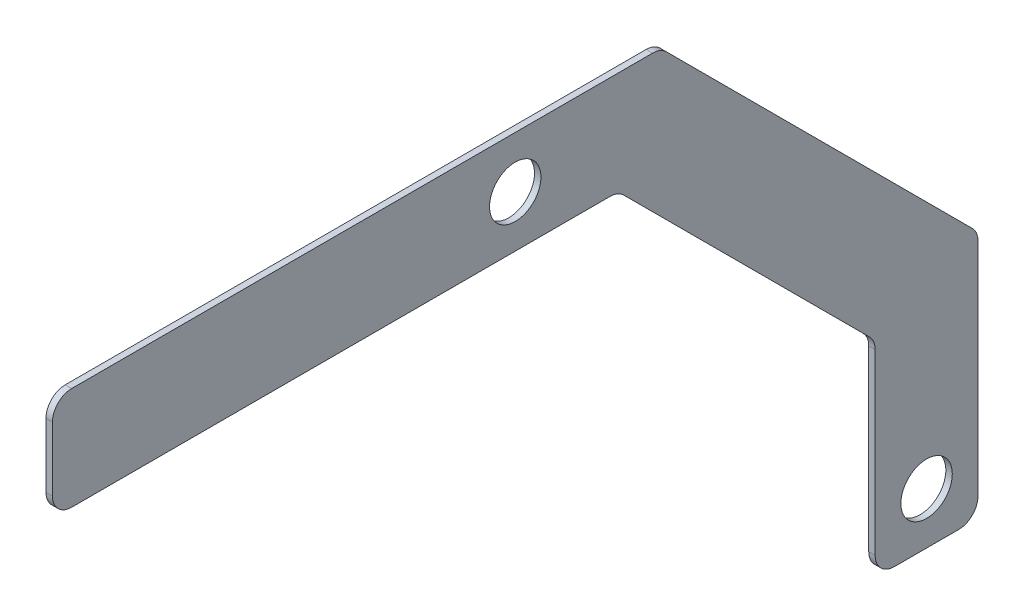
ISO-10303-21;
HEADER;
FILE_DESCRIPTION(('STEP AP214'),'2;1');
FILE_NAME('part.step','',(''),(''),'','','');
FILE_SCHEMA(('AUTOMOTIVE_DESIGN { 1 0 10303 214 1 1 1 1 }'));
ENDSEC;
DATA;
#1=APPLICATION_CONTEXT('core data for automotive mechanical design processes');
#2=APPLICATION_PROTOCOL_DEFINITION('international standard','automotive_design',2000,#1);
#3=PRODUCT_CONTEXT('',#1,'mechanical');
#4=PRODUCT('Part','Part','',(#3));
#5=PRODUCT_RELATED_PRODUCT_CATEGORY('part','',(#4));
#6=PRODUCT_DEFINITION_FORMATION('','',#4);
#7=PRODUCT_DEFINITION_CONTEXT('part definition',#1,'design');
#8=PRODUCT_DEFINITION('design','',#6,#7);
#9=PRODUCT_DEFINITION_SHAPE('','',#8);
#10=(LENGTH_UNIT() NAMED_UNIT(*) SI_UNIT(.MILLI.,.METRE.));
#11=(NAMED_UNIT(*) PLANE_ANGLE_UNIT() SI_UNIT($,.RADIAN.));
#12=(NAMED_UNIT(*) SI_UNIT($,.STERADIAN.) SOLID_ANGLE_UNIT());
#13=UNCERTAINTY_MEASURE_WITH_UNIT(LENGTH_MEASURE(1.E-05),#10,'distance_accuracy_value','');
#14=(GEOMETRIC_REPRESENTATION_CONTEXT(3) GLOBAL_UNCERTAINTY_ASSIGNED_CONTEXT((#13)) GLOBAL_UNIT_ASSIGNED_CONTEXT((#10,
#11,#12)) REPRESENTATION_CONTEXT('',''));
#15=CARTESIAN_POINT('',(0.,0.,0.));
#16=DIRECTION('',(0.,0.,1.));
#17=DIRECTION('',(1.,0.,0.));
#18=AXIS2_PLACEMENT_3D('',#15,#16,#17);
#19=CARTESIAN_POINT('',(3.175,0.,0.));
#20=DIRECTION('',(1.,0.,0.));
#21=DIRECTION('',(0.,0.,-1.));
#22=AXIS2_PLACEMENT_3D('',#19,#20,#21);
#23=PLANE('',#22);
#24=DIRECTION('',(0.,0.,-1.));
#25=VECTOR('',#24,1.);
#26=CARTESIAN_POINT('',(3.175,-254.,-228.6));
#27=LINE('',#26,#25);
#28=CARTESIAN_POINT('',(3.175,-254.,-187.325));
#29=VERTEX_POINT('',#28);
#30=CARTESIAN_POINT('',(3.175,-254.,-219.075));
#31=VERTEX_POINT('',#30);
#32=EDGE_CURVE('E277',#29,#31,#27,.T.);
#33=ORIENTED_EDGE('',*,*,#32,.T.);
#34=CARTESIAN_POINT('',(3.175,-244.475,-219.075));
#35=DIRECTION('',(1.,0.,0.));
#36=DIRECTION('',(0.,0.,-1.));
#37=AXIS2_PLACEMENT_3D('',#34,#35,#36);
#38=CIRCLE('',#37,9.525);
#39=CARTESIAN_POINT('',(3.175,-244.475,-228.6));
#40=VERTEX_POINT('',#39);
#41=EDGE_CURVE('E209',#31,#40,#38,.T.);
#42=ORIENTED_EDGE('',*,*,#41,.T.);
#43=DIRECTION('',(0.,1.,0.));
#44=VECTOR('',#43,1.);
#45=CARTESIAN_POINT('',(3.175,25.3999999999999,-228.6));
#46=LINE('',#45,#44);
#47=CARTESIAN_POINT('',(3.175,-135.303335213051,-228.6));
#48=VERTEX_POINT('',#47);
#49=EDGE_CURVE('E168',#40,#48,#46,.T.);
#50=ORIENTED_EDGE('',*,*,#49,.T.);
#51=CARTESIAN_POINT('',(3.175,-135.303335213051,-219.075));
#52=DIRECTION('',(1.,0.,0.));
#53=DIRECTION('',(0.,0.,-1.));
#54=AXIS2_PLACEMENT_3D('',#51,#52,#53);
#55=CIRCLE('',#54,9.525);
#56=CARTESIAN_POINT('',(3.175,-128.568143122249,-225.810192090802));
#57=VERTEX_POINT('',#56);
#58=EDGE_CURVE('E205',#48,#57,#55,.T.);
#59=ORIENTED_EDGE('',*,*,#58,.T.);
#60=DIRECTION('',(0.,-0.707106781186547,-0.707106781186547));
#61=VECTOR('',#60,1.);
#62=CARTESIAN_POINT('',(3.175,25.3999999999999,-71.8420489685532));
#63=LINE('',#62,#61);
#64=CARTESIAN_POINT('',(3.175,22.6101920908018,-74.6318568777513));
#65=VERTEX_POINT('',#64);
#66=EDGE_CURVE('E296',#65,#57,#63,.T.);
#67=ORIENTED_EDGE('',*,*,#66,.F.);
#68=CARTESIAN_POINT('',(3.175,15.875,-67.8966647869494));
#69=DIRECTION('',(1.,0.,0.));
#70=DIRECTION('',(0.,0.,-1.));
#71=AXIS2_PLACEMENT_3D('',#68,#69,#70);
#72=CIRCLE('',#71,9.525);
#73=CARTESIAN_POINT('',(3.175,25.4,-67.8966647869495));
#74=VERTEX_POINT('',#73);
#75=EDGE_CURVE('E203',#65,#74,#72,.T.);
#76=ORIENTED_EDGE('',*,*,#75,.T.);
#77=DIRECTION('',(0.,0.,1.));
#78=VECTOR('',#77,1.);
#79=CARTESIAN_POINT('',(3.175,25.4,228.6));
#80=LINE('',#79,#78);
#81=CARTESIAN_POINT('',(3.175,25.4,219.075));
#82=VERTEX_POINT('',#81);
#83=EDGE_CURVE('E187',#74,#82,#80,.T.);
#84=ORIENTED_EDGE('',*,*,#83,.T.);
#85=CARTESIAN_POINT('',(3.175,15.875,219.075));
#86=DIRECTION('',(1.,0.,0.));
#87=DIRECTION('',(0.,0.,-1.));
#88=AXIS2_PLACEMENT_3D('',#85,#86,#87);
#89=CIRCLE('',#88,9.525);
#90=CARTESIAN_POINT('',(3.175,15.875,228.6));
#91=VERTEX_POINT('',#90);
#92=EDGE_CURVE('E199',#82,#91,#89,.T.);
#93=ORIENTED_EDGE('',*,*,#92,.T.);
#94=DIRECTION('',(0.,-1.,0.));
#95=VECTOR('',#94,1.);
#96=CARTESIAN_POINT('',(3.175,25.4,228.6));
#97=LINE('',#96,#95);
#98=CARTESIAN_POINT('',(3.175,-15.875,228.6));
#99=VERTEX_POINT('',#98);
#100=EDGE_CURVE('E181',#91,#99,#97,.T.);
#101=ORIENTED_EDGE('',*,*,#100,.T.);
#102=CARTESIAN_POINT('',(3.175,-15.875,219.075));
#103=DIRECTION('',(1.,0.,0.));
#104=DIRECTION('',(0.,0.,-1.));
#105=AXIS2_PLACEMENT_3D('',#102,#103,#104);
#106=CIRCLE('',#105,9.525);
#107=CARTESIAN_POINT('',(3.175,-25.4,219.075));
#108=VERTEX_POINT('',#107);
#109=EDGE_CURVE('E201',#99,#108,#106,.T.);
#110=ORIENTED_EDGE('',*,*,#109,.T.);
#111=DIRECTION('',(0.,0.,-1.));
#112=VECTOR('',#111,1.);
#113=CARTESIAN_POINT('',(3.175,-25.4,177.8));
#114=LINE('',#113,#112);
#115=CARTESIAN_POINT('',(3.175,-25.4,-46.8546158183961));
#116=VERTEX_POINT('',#115);
#117=EDGE_CURVE('E247',#108,#116,#114,.T.);
#118=ORIENTED_EDGE('',*,*,#117,.T.);
#119=CARTESIAN_POINT('',(3.175,-34.925,-46.8546158183961));
#120=DIRECTION('',(1.,0.,0.));
#121=DIRECTION('',(0.,0.,-1.));
#122=AXIS2_PLACEMENT_3D('',#119,#120,#121);
#123=CIRCLE('',#122,9.525);
#124=CARTESIAN_POINT('',(3.175,-28.1898079091981,-53.589807909198));
#125=VERTEX_POINT('',#124);
#126=EDGE_CURVE('E42',#116,#125,#123,.F.);
#127=ORIENTED_EDGE('',*,*,#126,.T.);
#128=DIRECTION('',(0.,-0.707106781186549,-0.707106781186546));
#129=VECTOR('',#128,1.);
#130=CARTESIAN_POINT('',(3.175,-25.4,-50.7999999999999));
#131=LINE('',#130,#129);
#132=CARTESIAN_POINT('',(3.175,-149.610192090802,-175.010192090802));
#133=VERTEX_POINT('',#132);
#134=EDGE_CURVE('E245',#125,#133,#131,.T.);
#135=ORIENTED_EDGE('',*,*,#134,.T.);
#136=CARTESIAN_POINT('',(3.175,-156.345384181604,-168.275));
#137=DIRECTION('',(1.,0.,0.));
#138=DIRECTION('',(0.,0.,-1.));
#139=AXIS2_PLACEMENT_3D('',#136,#137,#138);
#140=CIRCLE('',#139,9.525);
#141=CARTESIAN_POINT('',(3.175,-156.345384181604,-177.8));
#142=VERTEX_POINT('',#141);
#143=EDGE_CURVE('E56',#133,#142,#140,.F.);
#144=ORIENTED_EDGE('',*,*,#143,.T.);
#145=DIRECTION('',(0.,-1.,0.));
#146=VECTOR('',#145,1.);
#147=CARTESIAN_POINT('',(3.175,-25.4,-177.8));
#148=LINE('',#147,#146);
#149=CARTESIAN_POINT('',(3.175,-244.475,-177.8));
#150=VERTEX_POINT('',#149);
#151=EDGE_CURVE('E279',#142,#150,#148,.T.);
#152=ORIENTED_EDGE('',*,*,#151,.T.);
#153=CARTESIAN_POINT('',(3.175,-244.475,-187.325));
#154=DIRECTION('',(1.,0.,0.));
#155=DIRECTION('',(0.,0.,-1.));
#156=AXIS2_PLACEMENT_3D('',#153,#154,#155);
#157=CIRCLE('',#156,9.525);
#158=EDGE_CURVE('E207',#150,#29,#157,.T.);
#159=ORIENTED_EDGE('',*,*,#158,.T.);
#160=EDGE_LOOP('',(#33,#42,#50,#59,#67,#76,#84,#93,#101,#110,#118,#127,#135,#144,#152,#159));
#161=FACE_BOUND('',#160,.T.);
#162=CARTESIAN_POINT('',(3.175,-228.6,-203.2));
#163=DIRECTION('',(1.,0.,0.));
#164=DIRECTION('',(0.,0.,-1.));
#165=AXIS2_PLACEMENT_3D('',#162,#163,#164);
#166=CIRCLE('',#165,12.7);
#167=CARTESIAN_POINT('',(3.175,-228.6,-215.9));
#168=VERTEX_POINT('',#167);
#169=EDGE_CURVE('E290',#168,#168,#166,.T.);
#170=ORIENTED_EDGE('',*,*,#169,.F.);
#171=EDGE_LOOP('',(#170));
#172=FACE_BOUND('',#171,.T.);
#173=CARTESIAN_POINT('',(3.175,0.,0.));
#174=DIRECTION('',(1.,0.,0.));
#175=DIRECTION('',(0.,0.,-1.));
#176=AXIS2_PLACEMENT_3D('',#173,#174,#175);
#177=CIRCLE('',#176,12.7);
#178=CARTESIAN_POINT('',(3.175,0.,-12.7));
#179=VERTEX_POINT('',#178);
#180=EDGE_CURVE('E271',#179,#179,#177,.T.);
#181=ORIENTED_EDGE('',*,*,#180,.F.);
#182=EDGE_LOOP('',(#181));
#183=FACE_BOUND('',#182,.T.);
#184=ADVANCED_FACE('F34',(#161,#172,#183),#23,.T.);
#185=CARTESIAN_POINT('',(0.,0.,0.));
#186=DIRECTION('',(1.,0.,0.));
#187=DIRECTION('',(0.,0.,-1.));
#188=AXIS2_PLACEMENT_3D('',#185,#186,#187);
#189=PLANE('',#188);
#190=DIRECTION('',(0.,1.,0.));
#191=VECTOR('',#190,1.);
#192=CARTESIAN_POINT('',(0.,25.3999999999999,-228.6));
#193=LINE('',#192,#191);
#194=CARTESIAN_POINT('',(0.,-244.475,-228.6));
#195=VERTEX_POINT('',#194);
#196=CARTESIAN_POINT('',(0.,-135.303335213051,-228.6));
#197=VERTEX_POINT('',#196);
#198=EDGE_CURVE('E165',#195,#197,#193,.T.);
#199=ORIENTED_EDGE('',*,*,#198,.F.);
#200=CARTESIAN_POINT('',(0.,-244.475,-219.075));
#201=DIRECTION('',(1.,0.,0.));
#202=DIRECTION('',(0.,0.,-1.));
#203=AXIS2_PLACEMENT_3D('',#200,#201,#202);
#204=CIRCLE('',#203,9.525);
#205=CARTESIAN_POINT('',(0.,-254.,-219.075));
#206=VERTEX_POINT('',#205);
#207=EDGE_CURVE('E147',#195,#206,#204,.F.);
#208=ORIENTED_EDGE('',*,*,#207,.T.);
#209=DIRECTION('',(0.,0.,-1.));
#210=VECTOR('',#209,1.);
#211=CARTESIAN_POINT('',(0.,-254.,-228.6));
#212=LINE('',#211,#210);
#213=CARTESIAN_POINT('',(0.,-254.,-187.325));
#214=VERTEX_POINT('',#213);
#215=EDGE_CURVE('E178',#214,#206,#212,.T.);
#216=ORIENTED_EDGE('',*,*,#215,.F.);
#217=CARTESIAN_POINT('',(0.,-244.475,-187.325));
#218=DIRECTION('',(1.,0.,0.));
#219=DIRECTION('',(0.,0.,-1.));
#220=AXIS2_PLACEMENT_3D('',#217,#218,#219);
#221=CIRCLE('',#220,9.525);
#222=CARTESIAN_POINT('',(0.,-244.475,-177.8));
#223=VERTEX_POINT('',#222);
#224=EDGE_CURVE('E158',#214,#223,#221,.F.);
#225=ORIENTED_EDGE('',*,*,#224,.T.);
#226=DIRECTION('',(0.,-1.,0.));
#227=VECTOR('',#226,1.);
#228=CARTESIAN_POINT('',(0.,-25.4,-177.8));
#229=LINE('',#228,#227);
#230=CARTESIAN_POINT('',(0.,-156.345384181604,-177.8));
#231=VERTEX_POINT('',#230);
#232=EDGE_CURVE('E183',#231,#223,#229,.T.);
#233=ORIENTED_EDGE('',*,*,#232,.F.);
#234=CARTESIAN_POINT('',(0.,-156.345384181604,-168.275));
#235=DIRECTION('',(1.,0.,0.));
#236=DIRECTION('',(0.,0.,-1.));
#237=AXIS2_PLACEMENT_3D('',#234,#235,#236);
#238=CIRCLE('',#237,9.525);
#239=CARTESIAN_POINT('',(0.,-149.610192090802,-175.010192090802));
#240=VERTEX_POINT('',#239);
#241=EDGE_CURVE('E240',#231,#240,#238,.T.);
#242=ORIENTED_EDGE('',*,*,#241,.T.);
#243=DIRECTION('',(0.,-0.707106781186549,-0.707106781186546));
#244=VECTOR('',#243,1.);
#245=CARTESIAN_POINT('',(0.,-25.4,-50.7999999999999));
#246=LINE('',#245,#244);
#247=CARTESIAN_POINT('',(0.,-28.1898079091981,-53.589807909198));
#248=VERTEX_POINT('',#247);
#249=EDGE_CURVE('E256',#248,#240,#246,.T.);
#250=ORIENTED_EDGE('',*,*,#249,.F.);
#251=CARTESIAN_POINT('',(0.,-34.925,-46.8546158183961));
#252=DIRECTION('',(1.,0.,0.));
#253=DIRECTION('',(0.,0.,-1.));
#254=AXIS2_PLACEMENT_3D('',#251,#252,#253);
#255=CIRCLE('',#254,9.525);
#256=CARTESIAN_POINT('',(0.,-25.4,-46.8546158183961));
#257=VERTEX_POINT('',#256);
#258=EDGE_CURVE('E11',#248,#257,#255,.T.);
#259=ORIENTED_EDGE('',*,*,#258,.T.);
#260=DIRECTION('',(0.,0.,-1.));
#261=VECTOR('',#260,1.);
#262=CARTESIAN_POINT('',(0.,-25.4,177.8));
#263=LINE('',#262,#261);
#264=CARTESIAN_POINT('',(0.,-25.4,219.075));
#265=VERTEX_POINT('',#264);
#266=EDGE_CURVE('E263',#265,#257,#263,.T.);
#267=ORIENTED_EDGE('',*,*,#266,.F.);
#268=CARTESIAN_POINT('',(0.,-15.875,219.075));
#269=DIRECTION('',(1.,0.,0.));
#270=DIRECTION('',(0.,0.,-1.));
#271=AXIS2_PLACEMENT_3D('',#268,#269,#270);
#272=CIRCLE('',#271,9.525);
#273=CARTESIAN_POINT('',(0.,-15.875,228.6));
#274=VERTEX_POINT('',#273);
#275=EDGE_CURVE('E190',#265,#274,#272,.F.);
#276=ORIENTED_EDGE('',*,*,#275,.T.);
#277=DIRECTION('',(0.,-1.,0.));
#278=VECTOR('',#277,1.);
#279=CARTESIAN_POINT('',(0.,25.4,228.6));
#280=LINE('',#279,#278);
#281=CARTESIAN_POINT('',(0.,15.875,228.6));
#282=VERTEX_POINT('',#281);
#283=EDGE_CURVE('E268',#282,#274,#280,.T.);
#284=ORIENTED_EDGE('',*,*,#283,.F.);
#285=CARTESIAN_POINT('',(0.,15.875,219.075));
#286=DIRECTION('',(1.,0.,0.));
#287=DIRECTION('',(0.,0.,-1.));
#288=AXIS2_PLACEMENT_3D('',#285,#286,#287);
#289=CIRCLE('',#288,9.525);
#290=CARTESIAN_POINT('',(0.,25.4,219.075));
#291=VERTEX_POINT('',#290);
#292=EDGE_CURVE('E169',#282,#291,#289,.F.);
#293=ORIENTED_EDGE('',*,*,#292,.T.);
#294=DIRECTION('',(0.,0.,1.));
#295=VECTOR('',#294,1.);
#296=CARTESIAN_POINT('',(0.,25.4,228.6));
#297=LINE('',#296,#295);
#298=CARTESIAN_POINT('',(0.,25.4,-67.8966647869495));
#299=VERTEX_POINT('',#298);
#300=EDGE_CURVE('E177',#299,#291,#297,.T.);
#301=ORIENTED_EDGE('',*,*,#300,.F.);
#302=CARTESIAN_POINT('',(0.,15.875,-67.8966647869494));
#303=DIRECTION('',(1.,0.,0.));
#304=DIRECTION('',(0.,0.,-1.));
#305=AXIS2_PLACEMENT_3D('',#302,#303,#304);
#306=CIRCLE('',#305,9.525);
#307=CARTESIAN_POINT('',(0.,22.6101920908018,-74.6318568777513));
#308=VERTEX_POINT('',#307);
#309=EDGE_CURVE('E192',#299,#308,#306,.F.);
#310=ORIENTED_EDGE('',*,*,#309,.T.);
#311=DIRECTION('',(0.,-0.707106781186547,-0.707106781186547));
#312=VECTOR('',#311,1.);
#313=CARTESIAN_POINT('',(0.,25.3999999999999,-71.8420489685532));
#314=LINE('',#313,#312);
#315=CARTESIAN_POINT('',(0.,-128.568143122249,-225.810192090802));
#316=VERTEX_POINT('',#315);
#317=EDGE_CURVE('E257',#308,#316,#314,.T.);
#318=ORIENTED_EDGE('',*,*,#317,.T.);
#319=CARTESIAN_POINT('',(0.,-135.303335213051,-219.075));
#320=DIRECTION('',(1.,0.,0.));
#321=DIRECTION('',(0.,0.,-1.));
#322=AXIS2_PLACEMENT_3D('',#319,#320,#321);
#323=CIRCLE('',#322,9.525);
#324=EDGE_CURVE('E176',#316,#197,#323,.F.);
#325=ORIENTED_EDGE('',*,*,#324,.T.);
#326=EDGE_LOOP('',(#199,#208,#216,#225,#233,#242,#250,#259,#267,#276,#284,#293,#301,#310,#318,#325));
#327=FACE_BOUND('',#326,.T.);
#328=CARTESIAN_POINT('',(0.,-228.6,-203.2));
#329=DIRECTION('',(1.,0.,0.));
#330=DIRECTION('',(0.,0.,-1.));
#331=AXIS2_PLACEMENT_3D('',#328,#329,#330);
#332=CIRCLE('',#331,12.7);
#333=CARTESIAN_POINT('',(0.,-228.6,-215.9));
#334=VERTEX_POINT('',#333);
#335=EDGE_CURVE('E287',#334,#334,#332,.T.);
#336=ORIENTED_EDGE('',*,*,#335,.T.);
#337=EDGE_LOOP('',(#336));
#338=FACE_BOUND('',#337,.T.);
#339=CARTESIAN_POINT('',(0.,0.,0.));
#340=DIRECTION('',(1.,0.,0.));
#341=DIRECTION('',(0.,0.,-1.));
#342=AXIS2_PLACEMENT_3D('',#339,#340,#341);
#343=CIRCLE('',#342,12.7);
#344=CARTESIAN_POINT('',(0.,0.,-12.7));
#345=VERTEX_POINT('',#344);
#346=EDGE_CURVE('E284',#345,#345,#343,.T.);
#347=ORIENTED_EDGE('',*,*,#346,.T.);
#348=EDGE_LOOP('',(#347));
#349=FACE_BOUND('',#348,.T.);
#350=ADVANCED_FACE('F172',(#327,#338,#349),#189,.F.);
#351=CARTESIAN_POINT('',(3.175,25.4,228.6));
#352=DIRECTION('',(0.,0.,-1.));
#353=DIRECTION('',(0.,1.,0.));
#354=AXIS2_PLACEMENT_3D('',#351,#352,#353);
#355=PLANE('',#354);
#356=ORIENTED_EDGE('',*,*,#283,.T.);
#357=DIRECTION('',(1.,0.,0.));
#358=VECTOR('',#357,1.);
#359=CARTESIAN_POINT('',(3.175,-15.875,228.6));
#360=LINE('',#359,#358);
#361=EDGE_CURVE('E236',#274,#99,#360,.T.);
#362=ORIENTED_EDGE('',*,*,#361,.T.);
#363=ORIENTED_EDGE('',*,*,#100,.F.);
#364=DIRECTION('',(-1.,0.,0.));
#365=VECTOR('',#364,1.);
#366=CARTESIAN_POINT('',(3.175,15.875,228.6));
#367=LINE('',#366,#365);
#368=EDGE_CURVE('E233',#91,#282,#367,.T.);
#369=ORIENTED_EDGE('',*,*,#368,.T.);
#370=EDGE_LOOP('',(#356,#362,#363,#369));
#371=FACE_BOUND('',#370,.T.);
#372=ADVANCED_FACE('F335',(#371),#355,.F.);
#373=CARTESIAN_POINT('',(3.175,-25.4,177.8));
#374=DIRECTION('',(0.,1.,0.));
#375=DIRECTION('',(0.,0.,1.));
#376=AXIS2_PLACEMENT_3D('',#373,#374,#375);
#377=PLANE('',#376);
#378=ORIENTED_EDGE('',*,*,#266,.T.);
#379=DIRECTION('',(1.,0.,0.));
#380=VECTOR('',#379,1.);
#381=CARTESIAN_POINT('',(3.175,-25.4,-46.8546158183961));
#382=LINE('',#381,#380);
#383=EDGE_CURVE('E230',#257,#116,#382,.T.);
#384=ORIENTED_EDGE('',*,*,#383,.T.);
#385=ORIENTED_EDGE('',*,*,#117,.F.);
#386=DIRECTION('',(1.,0.,0.));
#387=VECTOR('',#386,1.);
#388=CARTESIAN_POINT('',(3.175,-25.4,219.075));
#389=LINE('',#388,#387);
#390=EDGE_CURVE('E228',#108,#265,#389,.F.);
#391=ORIENTED_EDGE('',*,*,#390,.T.);
#392=EDGE_LOOP('',(#378,#384,#385,#391));
#393=FACE_BOUND('',#392,.T.);
#394=ADVANCED_FACE('F266',(#393),#377,.F.);
#395=CARTESIAN_POINT('',(3.175,-25.4,-177.8));
#396=DIRECTION('',(0.,0.,-1.));
#397=DIRECTION('',(0.,1.,0.));
#398=AXIS2_PLACEMENT_3D('',#395,#396,#397);
#399=PLANE('',#398);
#400=ORIENTED_EDGE('',*,*,#232,.T.);
#401=DIRECTION('',(-1.,0.,0.));
#402=VECTOR('',#401,1.);
#403=CARTESIAN_POINT('',(3.175,-244.475,-177.8));
#404=LINE('',#403,#402);
#405=EDGE_CURVE('E49',#223,#150,#404,.F.);
#406=ORIENTED_EDGE('',*,*,#405,.T.);
#407=ORIENTED_EDGE('',*,*,#151,.F.);
#408=DIRECTION('',(1.,0.,0.));
#409=VECTOR('',#408,1.);
#410=CARTESIAN_POINT('',(3.175,-156.345384181604,-177.8));
#411=LINE('',#410,#409);
#412=EDGE_CURVE('E211',#142,#231,#411,.F.);
#413=ORIENTED_EDGE('',*,*,#412,.T.);
#414=EDGE_LOOP('',(#400,#406,#407,#413));
#415=FACE_BOUND('',#414,.T.);
#416=ADVANCED_FACE('F317',(#415),#399,.F.);
#417=CARTESIAN_POINT('',(3.175,-254.,-228.6));
#418=DIRECTION('',(0.,1.,0.));
#419=DIRECTION('',(0.,0.,1.));
#420=AXIS2_PLACEMENT_3D('',#417,#418,#419);
#421=PLANE('',#420);
#422=ORIENTED_EDGE('',*,*,#215,.T.);
#423=DIRECTION('',(-1.,0.,0.));
#424=VECTOR('',#423,1.);
#425=CARTESIAN_POINT('',(3.175,-254.,-219.075));
#426=LINE('',#425,#424);
#427=EDGE_CURVE('E152',#206,#31,#426,.F.);
#428=ORIENTED_EDGE('',*,*,#427,.T.);
#429=ORIENTED_EDGE('',*,*,#32,.F.);
#430=DIRECTION('',(-1.,0.,0.));
#431=VECTOR('',#430,1.);
#432=CARTESIAN_POINT('',(3.175,-254.,-187.325));
#433=LINE('',#432,#431);
#434=EDGE_CURVE('E157',#29,#214,#433,.T.);
#435=ORIENTED_EDGE('',*,*,#434,.T.);
#436=EDGE_LOOP('',(#422,#428,#429,#435));
#437=FACE_BOUND('',#436,.T.);
#438=ADVANCED_FACE('F312',(#437),#421,.F.);
#439=CARTESIAN_POINT('',(3.175,25.3999999999999,-228.6));
#440=DIRECTION('',(0.,0.,1.));
#441=DIRECTION('',(0.,-1.,0.));
#442=AXIS2_PLACEMENT_3D('',#439,#440,#441);
#443=PLANE('',#442);
#444=ORIENTED_EDGE('',*,*,#49,.F.);
#445=DIRECTION('',(-1.,0.,0.));
#446=VECTOR('',#445,1.);
#447=CARTESIAN_POINT('',(3.175,-244.475,-228.6));
#448=LINE('',#447,#446);
#449=EDGE_CURVE('E151',#40,#195,#448,.T.);
#450=ORIENTED_EDGE('',*,*,#449,.T.);
#451=ORIENTED_EDGE('',*,*,#198,.T.);
#452=DIRECTION('',(1.,0.,0.));
#453=VECTOR('',#452,1.);
#454=CARTESIAN_POINT('',(3.175,-135.303335213051,-228.6));
#455=LINE('',#454,#453);
#456=EDGE_CURVE('E170',#197,#48,#455,.T.);
#457=ORIENTED_EDGE('',*,*,#456,.T.);
#458=EDGE_LOOP('',(#444,#450,#451,#457));
#459=FACE_BOUND('',#458,.T.);
#460=ADVANCED_FACE('F163',(#459),#443,.F.);
#461=CARTESIAN_POINT('',(3.175,25.4,228.6));
#462=DIRECTION('',(0.,-1.,0.));
#463=DIRECTION('',(0.,0.,-1.));
#464=AXIS2_PLACEMENT_3D('',#461,#462,#463);
#465=PLANE('',#464);
#466=ORIENTED_EDGE('',*,*,#83,.F.);
#467=DIRECTION('',(1.,0.,0.));
#468=VECTOR('',#467,1.);
#469=CARTESIAN_POINT('',(3.175,25.4,-67.8966647869495));
#470=LINE('',#469,#468);
#471=EDGE_CURVE('E226',#74,#299,#470,.F.);
#472=ORIENTED_EDGE('',*,*,#471,.T.);
#473=ORIENTED_EDGE('',*,*,#300,.T.);
#474=DIRECTION('',(-1.,0.,0.));
#475=VECTOR('',#474,1.);
#476=CARTESIAN_POINT('',(3.175,25.4,219.075));
#477=LINE('',#476,#475);
#478=EDGE_CURVE('E224',#291,#82,#477,.F.);
#479=ORIENTED_EDGE('',*,*,#478,.T.);
#480=EDGE_LOOP('',(#466,#472,#473,#479));
#481=FACE_BOUND('',#480,.T.);
#482=ADVANCED_FACE('F341',(#481),#465,.F.);
#483=CARTESIAN_POINT('',(3.175,0.,0.));
#484=DIRECTION('',(-1.,0.,0.));
#485=DIRECTION('',(0.,0.,1.));
#486=AXIS2_PLACEMENT_3D('',#483,#484,#485);
#487=CYLINDRICAL_SURFACE('',#486,12.7);
#488=ORIENTED_EDGE('',*,*,#180,.T.);
#489=EDGE_LOOP('',(#488));
#490=FACE_BOUND('',#489,.T.);
#491=ORIENTED_EDGE('',*,*,#346,.F.);
#492=EDGE_LOOP('',(#491));
#493=FACE_BOUND('',#492,.T.);
#494=ADVANCED_FACE('F338',(#490,#493),#487,.F.);
#495=CARTESIAN_POINT('',(0.,-228.6,-203.2));
#496=DIRECTION('',(1.,0.,0.));
#497=DIRECTION('',(0.,0.,-1.));
#498=AXIS2_PLACEMENT_3D('',#495,#496,#497);
#499=CYLINDRICAL_SURFACE('',#498,12.7);
#500=ORIENTED_EDGE('',*,*,#335,.F.);
#501=EDGE_LOOP('',(#500));
#502=FACE_BOUND('',#501,.T.);
#503=ORIENTED_EDGE('',*,*,#169,.T.);
#504=EDGE_LOOP('',(#503));
#505=FACE_BOUND('',#504,.T.);
#506=ADVANCED_FACE('F365',(#502,#505),#499,.F.);
#507=CARTESIAN_POINT('',(0.,-25.4,-50.7999999999999));
#508=DIRECTION('',(0.,-0.707106781186546,0.707106781186549));
#509=DIRECTION('',(0.,-0.707106781186549,-0.707106781186546));
#510=AXIS2_PLACEMENT_3D('',#507,#508,#509);
#511=PLANE('',#510);
#512=ORIENTED_EDGE('',*,*,#249,.T.);
#513=DIRECTION('',(1.,0.,0.));
#514=VECTOR('',#513,1.);
#515=CARTESIAN_POINT('',(0.,-149.610192090802,-175.010192090802));
#516=LINE('',#515,#514);
#517=EDGE_CURVE('E216',#240,#133,#516,.T.);
#518=ORIENTED_EDGE('',*,*,#517,.T.);
#519=ORIENTED_EDGE('',*,*,#134,.F.);
#520=DIRECTION('',(1.,0.,0.));
#521=VECTOR('',#520,1.);
#522=CARTESIAN_POINT('',(0.,-28.1898079091981,-53.589807909198));
#523=LINE('',#522,#521);
#524=EDGE_CURVE('E214',#125,#248,#523,.F.);
#525=ORIENTED_EDGE('',*,*,#524,.T.);
#526=EDGE_LOOP('',(#512,#518,#519,#525));
#527=FACE_BOUND('',#526,.T.);
#528=ADVANCED_FACE('F253',(#527),#511,.T.);
#529=CARTESIAN_POINT('',(0.,25.3999999999999,-71.8420489685532));
#530=DIRECTION('',(0.,-0.707106781186548,0.707106781186548));
#531=DIRECTION('',(0.,-0.707106781186548,-0.707106781186548));
#532=AXIS2_PLACEMENT_3D('',#529,#530,#531);
#533=PLANE('',#532);
#534=ORIENTED_EDGE('',*,*,#66,.T.);
#535=DIRECTION('',(1.,0.,0.));
#536=VECTOR('',#535,1.);
#537=CARTESIAN_POINT('',(0.,-128.568143122249,-225.810192090802));
#538=LINE('',#537,#536);
#539=EDGE_CURVE('E222',#57,#316,#538,.F.);
#540=ORIENTED_EDGE('',*,*,#539,.T.);
#541=ORIENTED_EDGE('',*,*,#317,.F.);
#542=DIRECTION('',(1.,0.,0.));
#543=VECTOR('',#542,1.);
#544=CARTESIAN_POINT('',(0.,22.6101920908018,-74.6318568777513));
#545=LINE('',#544,#543);
#546=EDGE_CURVE('E219',#308,#65,#545,.T.);
#547=ORIENTED_EDGE('',*,*,#546,.T.);
#548=EDGE_LOOP('',(#534,#540,#541,#547));
#549=FACE_BOUND('',#548,.T.);
#550=ADVANCED_FACE('F357',(#549),#533,.F.);
#551=CARTESIAN_POINT('',(3.175,-244.475,-219.075));
#552=DIRECTION('',(-1.,0.,0.));
#553=DIRECTION('',(0.,0.,1.));
#554=AXIS2_PLACEMENT_3D('',#551,#552,#553);
#555=CYLINDRICAL_SURFACE('',#554,9.525);
#556=ORIENTED_EDGE('',*,*,#41,.F.);
#557=ORIENTED_EDGE('',*,*,#427,.F.);
#558=ORIENTED_EDGE('',*,*,#207,.F.);
#559=ORIENTED_EDGE('',*,*,#449,.F.);
#560=EDGE_LOOP('',(#556,#557,#558,#559));
#561=FACE_BOUND('',#560,.T.);
#562=ADVANCED_FACE('F150',(#561),#555,.T.);
#563=CARTESIAN_POINT('',(3.175,-244.475,-187.325));
#564=DIRECTION('',(-1.,0.,0.));
#565=DIRECTION('',(0.,0.,1.));
#566=AXIS2_PLACEMENT_3D('',#563,#564,#565);
#567=CYLINDRICAL_SURFACE('',#566,9.525);
#568=ORIENTED_EDGE('',*,*,#158,.F.);
#569=ORIENTED_EDGE('',*,*,#405,.F.);
#570=ORIENTED_EDGE('',*,*,#224,.F.);
#571=ORIENTED_EDGE('',*,*,#434,.F.);
#572=EDGE_LOOP('',(#568,#569,#570,#571));
#573=FACE_BOUND('',#572,.T.);
#574=ADVANCED_FACE('F314',(#573),#567,.T.);
#575=CARTESIAN_POINT('',(0.,-156.345384181604,-168.275));
#576=DIRECTION('',(1.,0.,0.));
#577=DIRECTION('',(0.,0.,-1.));
#578=AXIS2_PLACEMENT_3D('',#575,#576,#577);
#579=CYLINDRICAL_SURFACE('',#578,9.525);
#580=ORIENTED_EDGE('',*,*,#241,.F.);
#581=ORIENTED_EDGE('',*,*,#412,.F.);
#582=ORIENTED_EDGE('',*,*,#143,.F.);
#583=ORIENTED_EDGE('',*,*,#517,.F.);
#584=EDGE_LOOP('',(#580,#581,#582,#583));
#585=FACE_BOUND('',#584,.T.);
#586=ADVANCED_FACE('F320',(#585),#579,.F.);
#587=CARTESIAN_POINT('',(3.175,-135.303335213051,-219.075));
#588=DIRECTION('',(1.,0.,0.));
#589=DIRECTION('',(0.,0.,-1.));
#590=AXIS2_PLACEMENT_3D('',#587,#588,#589);
#591=CYLINDRICAL_SURFACE('',#590,9.525);
#592=ORIENTED_EDGE('',*,*,#324,.F.);
#593=ORIENTED_EDGE('',*,*,#539,.F.);
#594=ORIENTED_EDGE('',*,*,#58,.F.);
#595=ORIENTED_EDGE('',*,*,#456,.F.);
#596=EDGE_LOOP('',(#592,#593,#594,#595));
#597=FACE_BOUND('',#596,.T.);
#598=ADVANCED_FACE('F306',(#597),#591,.T.);
#599=CARTESIAN_POINT('',(0.,15.875,-67.8966647869494));
#600=DIRECTION('',(1.,0.,0.));
#601=DIRECTION('',(0.,0.,-1.));
#602=AXIS2_PLACEMENT_3D('',#599,#600,#601);
#603=CYLINDRICAL_SURFACE('',#602,9.525);
#604=ORIENTED_EDGE('',*,*,#309,.F.);
#605=ORIENTED_EDGE('',*,*,#471,.F.);
#606=ORIENTED_EDGE('',*,*,#75,.F.);
#607=ORIENTED_EDGE('',*,*,#546,.F.);
#608=EDGE_LOOP('',(#604,#605,#606,#607));
#609=FACE_BOUND('',#608,.T.);
#610=ADVANCED_FACE('F327',(#609),#603,.T.);
#611=CARTESIAN_POINT('',(3.175,-34.925,-46.8546158183961));
#612=DIRECTION('',(1.,0.,0.));
#613=DIRECTION('',(0.,0.,-1.));
#614=AXIS2_PLACEMENT_3D('',#611,#612,#613);
#615=CYLINDRICAL_SURFACE('',#614,9.525);
#616=ORIENTED_EDGE('',*,*,#258,.F.);
#617=ORIENTED_EDGE('',*,*,#524,.F.);
#618=ORIENTED_EDGE('',*,*,#126,.F.);
#619=ORIENTED_EDGE('',*,*,#383,.F.);
#620=EDGE_LOOP('',(#616,#617,#618,#619));
#621=FACE_BOUND('',#620,.T.);
#622=ADVANCED_FACE('F260',(#621),#615,.F.);
#623=CARTESIAN_POINT('',(3.175,-15.875,219.075));
#624=DIRECTION('',(1.,0.,0.));
#625=DIRECTION('',(0.,0.,-1.));
#626=AXIS2_PLACEMENT_3D('',#623,#624,#625);
#627=CYLINDRICAL_SURFACE('',#626,9.525);
#628=ORIENTED_EDGE('',*,*,#275,.F.);
#629=ORIENTED_EDGE('',*,*,#390,.F.);
#630=ORIENTED_EDGE('',*,*,#109,.F.);
#631=ORIENTED_EDGE('',*,*,#361,.F.);
#632=EDGE_LOOP('',(#628,#629,#630,#631));
#633=FACE_BOUND('',#632,.T.);
#634=ADVANCED_FACE('F487',(#633),#627,.T.);
#635=CARTESIAN_POINT('',(3.175,15.875,219.075));
#636=DIRECTION('',(-1.,0.,0.));
#637=DIRECTION('',(0.,0.,1.));
#638=AXIS2_PLACEMENT_3D('',#635,#636,#637);
#639=CYLINDRICAL_SURFACE('',#638,9.525);
#640=ORIENTED_EDGE('',*,*,#92,.F.);
#641=ORIENTED_EDGE('',*,*,#478,.F.);
#642=ORIENTED_EDGE('',*,*,#292,.F.);
#643=ORIENTED_EDGE('',*,*,#368,.F.);
#644=EDGE_LOOP('',(#640,#641,#642,#643));
#645=FACE_BOUND('',#644,.T.);
#646=ADVANCED_FACE('F36',(#645),#639,.T.);
#647=CLOSED_SHELL('',(#184,#350,#372,#394,#416,#438,#460,#482,#494,#506,#528,#550,#562,#574,
#586,#598,#610,#622,#634,#646));
#648=MANIFOLD_SOLID_BREP('B2',#647);
#649=ADVANCED_BREP_SHAPE_REPRESENTATION('',(#18,#648),#14);
#650=SHAPE_DEFINITION_REPRESENTATION(#9,#649);
ENDSEC;
END-ISO-10303-21;
